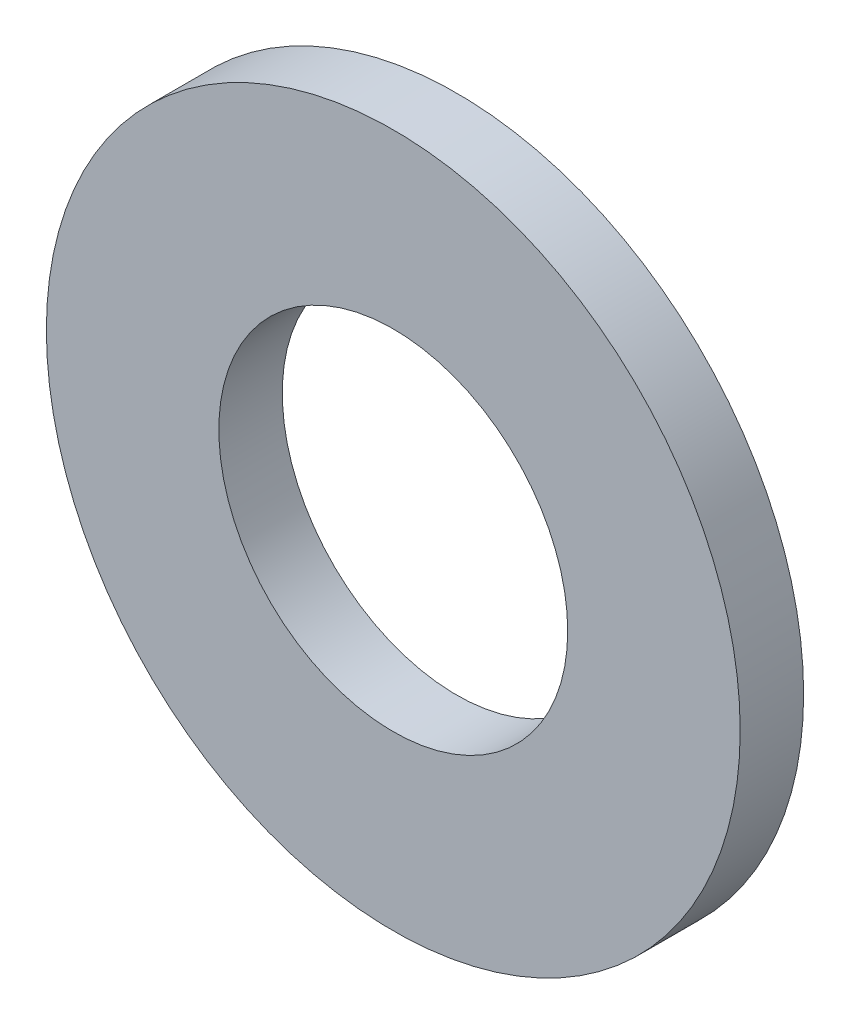
ISO-10303-21;
HEADER;
FILE_DESCRIPTION(('STEP AP214'),'2;1');
FILE_NAME('part.step','',(''),(''),'','','');
FILE_SCHEMA(('AUTOMOTIVE_DESIGN { 1 0 10303 214 1 1 1 1 }'));
ENDSEC;
DATA;
#1=APPLICATION_CONTEXT('core data for automotive mechanical design processes');
#2=APPLICATION_PROTOCOL_DEFINITION('international standard','automotive_design',2000,#1);
#3=PRODUCT_CONTEXT('',#1,'mechanical');
#4=PRODUCT('Part','Part','',(#3));
#5=PRODUCT_RELATED_PRODUCT_CATEGORY('part','',(#4));
#6=PRODUCT_DEFINITION_FORMATION('','',#4);
#7=PRODUCT_DEFINITION_CONTEXT('part definition',#1,'design');
#8=PRODUCT_DEFINITION('design','',#6,#7);
#9=PRODUCT_DEFINITION_SHAPE('','',#8);
#10=(LENGTH_UNIT() NAMED_UNIT(*) SI_UNIT(.MILLI.,.METRE.));
#11=(NAMED_UNIT(*) PLANE_ANGLE_UNIT() SI_UNIT($,.RADIAN.));
#12=(NAMED_UNIT(*) SI_UNIT($,.STERADIAN.) SOLID_ANGLE_UNIT());
#13=UNCERTAINTY_MEASURE_WITH_UNIT(LENGTH_MEASURE(1.E-05),#10,'distance_accuracy_value','');
#14=(GEOMETRIC_REPRESENTATION_CONTEXT(3) GLOBAL_UNCERTAINTY_ASSIGNED_CONTEXT((#13)) GLOBAL_UNIT_ASSIGNED_CONTEXT((#10,
#11,#12)) REPRESENTATION_CONTEXT('',''));
#15=CARTESIAN_POINT('',(0.,0.,0.));
#16=DIRECTION('',(0.,0.,1.));
#17=DIRECTION('',(1.,0.,0.));
#18=AXIS2_PLACEMENT_3D('',#15,#16,#17);
#19=CARTESIAN_POINT('',(0.,0.,1.016));
#20=DIRECTION('',(0.,0.,1.));
#21=DIRECTION('',(1.,0.,0.));
#22=AXIS2_PLACEMENT_3D('',#19,#20,#21);
#23=PLANE('',#22);
#24=CARTESIAN_POINT('',(0.,0.,1.016));
#25=DIRECTION('',(0.,0.,1.));
#26=DIRECTION('',(1.,0.,0.));
#27=AXIS2_PLACEMENT_3D('',#24,#25,#26);
#28=CIRCLE('',#27,2.794);
#29=CARTESIAN_POINT('',(2.794,0.,1.016));
#30=VERTEX_POINT('',#29);
#31=EDGE_CURVE('E31',#30,#30,#28,.F.);
#32=ORIENTED_EDGE('',*,*,#31,.T.);
#33=EDGE_LOOP('',(#32));
#34=FACE_BOUND('',#33,.T.);
#35=CARTESIAN_POINT('',(0.,0.,1.016));
#36=DIRECTION('',(0.,0.,1.));
#37=DIRECTION('',(1.,0.,0.));
#38=AXIS2_PLACEMENT_3D('',#35,#36,#37);
#39=CIRCLE('',#38,5.55625);
#40=CARTESIAN_POINT('',(5.55625,0.,1.016));
#41=VERTEX_POINT('',#40);
#42=EDGE_CURVE('E18',#41,#41,#39,.F.);
#43=ORIENTED_EDGE('',*,*,#42,.F.);
#44=EDGE_LOOP('',(#43));
#45=FACE_BOUND('',#44,.T.);
#46=ADVANCED_FACE('F15',(#34,#45),#23,.T.);
#47=CARTESIAN_POINT('',(0.,0.,0.));
#48=DIRECTION('',(0.,0.,1.));
#49=DIRECTION('',(1.,0.,0.));
#50=AXIS2_PLACEMENT_3D('',#47,#48,#49);
#51=CYLINDRICAL_SURFACE('',#50,5.55625);
#52=ORIENTED_EDGE('',*,*,#42,.T.);
#53=EDGE_LOOP('',(#52));
#54=FACE_BOUND('',#53,.T.);
#55=CARTESIAN_POINT('',(0.,0.,0.));
#56=DIRECTION('',(0.,0.,1.));
#57=DIRECTION('',(1.,0.,0.));
#58=AXIS2_PLACEMENT_3D('',#55,#56,#57);
#59=CIRCLE('',#58,5.55625);
#60=CARTESIAN_POINT('',(5.55625,0.,0.));
#61=VERTEX_POINT('',#60);
#62=EDGE_CURVE('E23',#61,#61,#59,.T.);
#63=ORIENTED_EDGE('',*,*,#62,.T.);
#64=EDGE_LOOP('',(#63));
#65=FACE_BOUND('',#64,.T.);
#66=ADVANCED_FACE('F40',(#54,#65),#51,.T.);
#67=CARTESIAN_POINT('',(0.,0.,0.));
#68=DIRECTION('',(0.,0.,1.));
#69=DIRECTION('',(1.,0.,0.));
#70=AXIS2_PLACEMENT_3D('',#67,#68,#69);
#71=CYLINDRICAL_SURFACE('',#70,2.794);
#72=ORIENTED_EDGE('',*,*,#31,.F.);
#73=EDGE_LOOP('',(#72));
#74=FACE_BOUND('',#73,.T.);
#75=CARTESIAN_POINT('',(0.,0.,0.));
#76=DIRECTION('',(0.,0.,1.));
#77=DIRECTION('',(1.,0.,0.));
#78=AXIS2_PLACEMENT_3D('',#75,#76,#77);
#79=CIRCLE('',#78,2.794);
#80=CARTESIAN_POINT('',(2.794,0.,0.));
#81=VERTEX_POINT('',#80);
#82=EDGE_CURVE('E10',#81,#81,#79,.F.);
#83=ORIENTED_EDGE('',*,*,#82,.T.);
#84=EDGE_LOOP('',(#83));
#85=FACE_BOUND('',#84,.T.);
#86=ADVANCED_FACE('F48',(#74,#85),#71,.F.);
#87=CARTESIAN_POINT('',(0.,0.,0.));
#88=DIRECTION('',(0.,0.,1.));
#89=DIRECTION('',(1.,0.,0.));
#90=AXIS2_PLACEMENT_3D('',#87,#88,#89);
#91=PLANE('',#90);
#92=ORIENTED_EDGE('',*,*,#82,.F.);
#93=EDGE_LOOP('',(#92));
#94=FACE_BOUND('',#93,.T.);
#95=ORIENTED_EDGE('',*,*,#62,.F.);
#96=EDGE_LOOP('',(#95));
#97=FACE_BOUND('',#96,.T.);
#98=ADVANCED_FACE('F49',(#94,#97),#91,.F.);
#99=CLOSED_SHELL('',(#46,#66,#86,#98));
#100=MANIFOLD_SOLID_BREP('B1',#99);
#101=ADVANCED_BREP_SHAPE_REPRESENTATION('',(#18,#100),#14);
#102=SHAPE_DEFINITION_REPRESENTATION(#9,#101);
ENDSEC;
END-ISO-10303-21;
